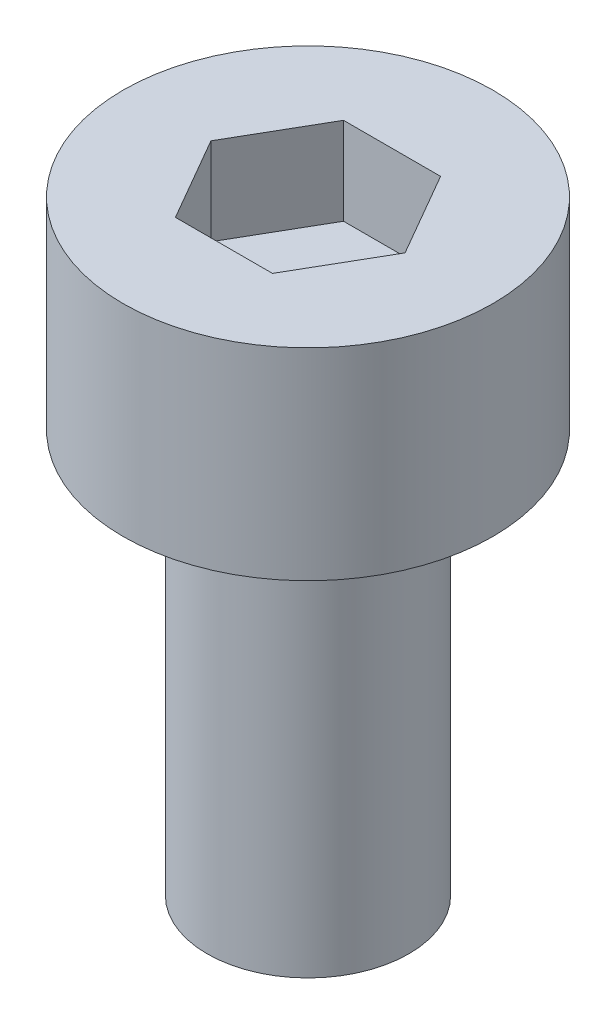
ISO-10303-21;
HEADER;
FILE_DESCRIPTION(('STEP AP214'),'2;1');
FILE_NAME('part.step','',(''),(''),'','','');
FILE_SCHEMA(('AUTOMOTIVE_DESIGN { 1 0 10303 214 1 1 1 1 }'));
ENDSEC;
DATA;
#1=APPLICATION_CONTEXT('core data for automotive mechanical design processes');
#2=APPLICATION_PROTOCOL_DEFINITION('international standard','automotive_design',2000,#1);
#3=PRODUCT_CONTEXT('',#1,'mechanical');
#4=PRODUCT('Part','Part','',(#3));
#5=PRODUCT_RELATED_PRODUCT_CATEGORY('part','',(#4));
#6=PRODUCT_DEFINITION_FORMATION('','',#4);
#7=PRODUCT_DEFINITION_CONTEXT('part definition',#1,'design');
#8=PRODUCT_DEFINITION('design','',#6,#7);
#9=PRODUCT_DEFINITION_SHAPE('','',#8);
#10=(LENGTH_UNIT() NAMED_UNIT(*) SI_UNIT(.MILLI.,.METRE.));
#11=(NAMED_UNIT(*) PLANE_ANGLE_UNIT() SI_UNIT($,.RADIAN.));
#12=(NAMED_UNIT(*) SI_UNIT($,.STERADIAN.) SOLID_ANGLE_UNIT());
#13=UNCERTAINTY_MEASURE_WITH_UNIT(LENGTH_MEASURE(1.E-05),#10,'distance_accuracy_value','');
#14=(GEOMETRIC_REPRESENTATION_CONTEXT(3) GLOBAL_UNCERTAINTY_ASSIGNED_CONTEXT((#13)) GLOBAL_UNIT_ASSIGNED_CONTEXT((#10,
#11,#12)) REPRESENTATION_CONTEXT('',''));
#15=CARTESIAN_POINT('',(0.,0.,0.));
#16=DIRECTION('',(0.,0.,1.));
#17=DIRECTION('',(1.,0.,0.));
#18=AXIS2_PLACEMENT_3D('',#15,#16,#17);
#19=CARTESIAN_POINT('',(0.,3.,0.));
#20=DIRECTION('',(0.,-1.,0.));
#21=DIRECTION('',(0.,0.,-1.));
#22=AXIS2_PLACEMENT_3D('',#19,#20,#21);
#23=CYLINDRICAL_SURFACE('',#22,2.75);
#24=CARTESIAN_POINT('',(0.,3.,0.));
#25=DIRECTION('',(0.,1.,0.));
#26=DIRECTION('',(0.,0.,1.));
#27=AXIS2_PLACEMENT_3D('',#24,#25,#26);
#28=CIRCLE('',#27,2.75);
#29=CARTESIAN_POINT('',(0.,3.,2.75));
#30=VERTEX_POINT('',#29);
#31=EDGE_CURVE('E45',#30,#30,#28,.T.);
#32=ORIENTED_EDGE('',*,*,#31,.F.);
#33=EDGE_LOOP('',(#32));
#34=FACE_BOUND('',#33,.T.);
#35=CARTESIAN_POINT('',(0.,0.,0.));
#36=DIRECTION('',(0.,1.,0.));
#37=DIRECTION('',(0.,0.,1.));
#38=AXIS2_PLACEMENT_3D('',#35,#36,#37);
#39=CIRCLE('',#38,2.75);
#40=CARTESIAN_POINT('',(0.,0.,2.75));
#41=VERTEX_POINT('',#40);
#42=EDGE_CURVE('E40',#41,#41,#39,.T.);
#43=ORIENTED_EDGE('',*,*,#42,.T.);
#44=EDGE_LOOP('',(#43));
#45=FACE_BOUND('',#44,.T.);
#46=ADVANCED_FACE('F37',(#34,#45),#23,.T.);
#47=CARTESIAN_POINT('',(0.,3.,0.));
#48=DIRECTION('',(0.,1.,0.));
#49=DIRECTION('',(0.,0.,1.));
#50=AXIS2_PLACEMENT_3D('',#47,#48,#49);
#51=PLANE('',#50);
#52=DIRECTION('',(0.5,0.,-0.866025403784439));
#53=VECTOR('',#52,1.);
#54=CARTESIAN_POINT('',(0.721687836487032,3.,1.25));
#55=LINE('',#54,#53);
#56=CARTESIAN_POINT('',(0.721687836487032,3.,1.25));
#57=VERTEX_POINT('',#56);
#58=CARTESIAN_POINT('',(1.44337567297406,3.,0.));
#59=VERTEX_POINT('',#58);
#60=EDGE_CURVE('E53',#57,#59,#55,.T.);
#61=ORIENTED_EDGE('',*,*,#60,.F.);
#62=DIRECTION('',(1.,0.,0.));
#63=VECTOR('',#62,1.);
#64=CARTESIAN_POINT('',(-0.721687836487033,3.,1.25));
#65=LINE('',#64,#63);
#66=CARTESIAN_POINT('',(-0.721687836487033,3.,1.25));
#67=VERTEX_POINT('',#66);
#68=EDGE_CURVE('E137',#67,#57,#65,.T.);
#69=ORIENTED_EDGE('',*,*,#68,.F.);
#70=DIRECTION('',(0.5,0.,0.866025403784439));
#71=VECTOR('',#70,1.);
#72=CARTESIAN_POINT('',(-1.44337567297407,3.,0.));
#73=LINE('',#72,#71);
#74=CARTESIAN_POINT('',(-1.44337567297407,3.,0.));
#75=VERTEX_POINT('',#74);
#76=EDGE_CURVE('E135',#75,#67,#73,.T.);
#77=ORIENTED_EDGE('',*,*,#76,.F.);
#78=DIRECTION('',(-0.5,0.,0.866025403784438));
#79=VECTOR('',#78,1.);
#80=CARTESIAN_POINT('',(-0.721687836487033,3.,-1.25));
#81=LINE('',#80,#79);
#82=CARTESIAN_POINT('',(-0.721687836487033,3.,-1.25));
#83=VERTEX_POINT('',#82);
#84=EDGE_CURVE('E101',#83,#75,#81,.T.);
#85=ORIENTED_EDGE('',*,*,#84,.F.);
#86=DIRECTION('',(-1.,0.,0.));
#87=VECTOR('',#86,1.);
#88=CARTESIAN_POINT('',(0.721687836487032,3.,-1.25));
#89=LINE('',#88,#87);
#90=CARTESIAN_POINT('',(0.721687836487032,3.,-1.25));
#91=VERTEX_POINT('',#90);
#92=EDGE_CURVE('E131',#91,#83,#89,.T.);
#93=ORIENTED_EDGE('',*,*,#92,.F.);
#94=DIRECTION('',(-0.5,0.,-0.866025403784439));
#95=VECTOR('',#94,1.);
#96=CARTESIAN_POINT('',(1.44337567297406,3.,0.));
#97=LINE('',#96,#95);
#98=EDGE_CURVE('E127',#59,#91,#97,.T.);
#99=ORIENTED_EDGE('',*,*,#98,.F.);
#100=EDGE_LOOP('',(#61,#69,#77,#85,#93,#99));
#101=FACE_BOUND('',#100,.T.);
#102=ORIENTED_EDGE('',*,*,#31,.T.);
#103=EDGE_LOOP('',(#102));
#104=FACE_BOUND('',#103,.T.);
#105=ADVANCED_FACE('F155',(#101,#104),#51,.T.);
#106=CARTESIAN_POINT('',(0.,0.,0.));
#107=DIRECTION('',(0.,1.,0.));
#108=DIRECTION('',(0.,0.,1.));
#109=AXIS2_PLACEMENT_3D('',#106,#107,#108);
#110=PLANE('',#109);
#111=CARTESIAN_POINT('',(0.,0.,0.));
#112=DIRECTION('',(0.,-1.,0.));
#113=DIRECTION('',(0.,0.,-1.));
#114=AXIS2_PLACEMENT_3D('',#111,#112,#113);
#115=CIRCLE('',#114,1.5);
#116=CARTESIAN_POINT('',(0.,0.,-1.5));
#117=VERTEX_POINT('',#116);
#118=EDGE_CURVE('E11',#117,#117,#115,.T.);
#119=ORIENTED_EDGE('',*,*,#118,.F.);
#120=EDGE_LOOP('',(#119));
#121=FACE_BOUND('',#120,.T.);
#122=ORIENTED_EDGE('',*,*,#42,.F.);
#123=EDGE_LOOP('',(#122));
#124=FACE_BOUND('',#123,.T.);
#125=ADVANCED_FACE('F152',(#121,#124),#110,.F.);
#126=CARTESIAN_POINT('',(0.721687836487032,1.7,1.25));
#127=DIRECTION('',(0.866025403784439,0.,0.5));
#128=DIRECTION('',(0.5,0.,-0.866025403784439));
#129=AXIS2_PLACEMENT_3D('',#126,#127,#128);
#130=PLANE('',#129);
#131=ORIENTED_EDGE('',*,*,#60,.T.);
#132=DIRECTION('',(0.,1.,0.));
#133=VECTOR('',#132,1.);
#134=CARTESIAN_POINT('',(1.44337567297406,1.7,0.));
#135=LINE('',#134,#133);
#136=CARTESIAN_POINT('',(1.44337567297406,1.7,0.));
#137=VERTEX_POINT('',#136);
#138=EDGE_CURVE('E83',#137,#59,#135,.T.);
#139=ORIENTED_EDGE('',*,*,#138,.F.);
#140=DIRECTION('',(0.5,0.,-0.866025403784439));
#141=VECTOR('',#140,1.);
#142=CARTESIAN_POINT('',(0.721687836487032,1.7,1.25));
#143=LINE('',#142,#141);
#144=CARTESIAN_POINT('',(0.721687836487032,1.7,1.25));
#145=VERTEX_POINT('',#144);
#146=EDGE_CURVE('E139',#145,#137,#143,.T.);
#147=ORIENTED_EDGE('',*,*,#146,.F.);
#148=DIRECTION('',(0.,1.,0.));
#149=VECTOR('',#148,1.);
#150=CARTESIAN_POINT('',(0.721687836487032,1.7,1.25));
#151=LINE('',#150,#149);
#152=EDGE_CURVE('E61',#145,#57,#151,.T.);
#153=ORIENTED_EDGE('',*,*,#152,.T.);
#154=EDGE_LOOP('',(#131,#139,#147,#153));
#155=FACE_BOUND('',#154,.T.);
#156=ADVANCED_FACE('F154',(#155),#130,.F.);
#157=CARTESIAN_POINT('',(-0.721687836487033,1.7,1.25));
#158=DIRECTION('',(0.,0.,1.));
#159=DIRECTION('',(1.,0.,0.));
#160=AXIS2_PLACEMENT_3D('',#157,#158,#159);
#161=PLANE('',#160);
#162=ORIENTED_EDGE('',*,*,#68,.T.);
#163=ORIENTED_EDGE('',*,*,#152,.F.);
#164=DIRECTION('',(1.,0.,0.));
#165=VECTOR('',#164,1.);
#166=CARTESIAN_POINT('',(-0.721687836487033,1.7,1.25));
#167=LINE('',#166,#165);
#168=CARTESIAN_POINT('',(-0.721687836487033,1.7,1.25));
#169=VERTEX_POINT('',#168);
#170=EDGE_CURVE('E113',#169,#145,#167,.T.);
#171=ORIENTED_EDGE('',*,*,#170,.F.);
#172=DIRECTION('',(0.,1.,0.));
#173=VECTOR('',#172,1.);
#174=CARTESIAN_POINT('',(-0.721687836487033,1.7,1.25));
#175=LINE('',#174,#173);
#176=EDGE_CURVE('E105',#169,#67,#175,.T.);
#177=ORIENTED_EDGE('',*,*,#176,.T.);
#178=EDGE_LOOP('',(#162,#163,#171,#177));
#179=FACE_BOUND('',#178,.T.);
#180=ADVANCED_FACE('F161',(#179),#161,.F.);
#181=CARTESIAN_POINT('',(-1.44337567297407,1.7,0.));
#182=DIRECTION('',(-0.866025403784439,0.,0.5));
#183=DIRECTION('',(0.5,0.,0.866025403784439));
#184=AXIS2_PLACEMENT_3D('',#181,#182,#183);
#185=PLANE('',#184);
#186=ORIENTED_EDGE('',*,*,#76,.T.);
#187=ORIENTED_EDGE('',*,*,#176,.F.);
#188=DIRECTION('',(0.5,0.,0.866025403784439));
#189=VECTOR('',#188,1.);
#190=CARTESIAN_POINT('',(-1.44337567297407,1.7,0.));
#191=LINE('',#190,#189);
#192=CARTESIAN_POINT('',(-1.44337567297407,1.7,0.));
#193=VERTEX_POINT('',#192);
#194=EDGE_CURVE('E109',#193,#169,#191,.T.);
#195=ORIENTED_EDGE('',*,*,#194,.F.);
#196=DIRECTION('',(0.,1.,0.));
#197=VECTOR('',#196,1.);
#198=CARTESIAN_POINT('',(-1.44337567297407,1.7,0.));
#199=LINE('',#198,#197);
#200=EDGE_CURVE('E94',#193,#75,#199,.T.);
#201=ORIENTED_EDGE('',*,*,#200,.T.);
#202=EDGE_LOOP('',(#186,#187,#195,#201));
#203=FACE_BOUND('',#202,.T.);
#204=ADVANCED_FACE('F110',(#203),#185,.F.);
#205=CARTESIAN_POINT('',(-0.721687836487033,1.7,-1.25));
#206=DIRECTION('',(-0.866025403784439,0.,-0.5));
#207=DIRECTION('',(-0.5,0.,0.866025403784439));
#208=AXIS2_PLACEMENT_3D('',#205,#206,#207);
#209=PLANE('',#208);
#210=ORIENTED_EDGE('',*,*,#84,.T.);
#211=ORIENTED_EDGE('',*,*,#200,.F.);
#212=DIRECTION('',(-0.5,0.,0.866025403784438));
#213=VECTOR('',#212,1.);
#214=CARTESIAN_POINT('',(-0.721687836487033,1.7,-1.25));
#215=LINE('',#214,#213);
#216=CARTESIAN_POINT('',(-0.721687836487033,1.7,-1.25));
#217=VERTEX_POINT('',#216);
#218=EDGE_CURVE('E98',#217,#193,#215,.T.);
#219=ORIENTED_EDGE('',*,*,#218,.F.);
#220=DIRECTION('',(0.,1.,0.));
#221=VECTOR('',#220,1.);
#222=CARTESIAN_POINT('',(-0.721687836487033,1.7,-1.25));
#223=LINE('',#222,#221);
#224=EDGE_CURVE('E106',#217,#83,#223,.T.);
#225=ORIENTED_EDGE('',*,*,#224,.T.);
#226=EDGE_LOOP('',(#210,#211,#219,#225));
#227=FACE_BOUND('',#226,.T.);
#228=ADVANCED_FACE('F96',(#227),#209,.F.);
#229=CARTESIAN_POINT('',(0.721687836487032,1.7,-1.25));
#230=DIRECTION('',(0.,0.,-1.));
#231=DIRECTION('',(-1.,0.,0.));
#232=AXIS2_PLACEMENT_3D('',#229,#230,#231);
#233=PLANE('',#232);
#234=ORIENTED_EDGE('',*,*,#92,.T.);
#235=ORIENTED_EDGE('',*,*,#224,.F.);
#236=DIRECTION('',(-1.,0.,0.));
#237=VECTOR('',#236,1.);
#238=CARTESIAN_POINT('',(0.721687836487032,1.7,-1.25));
#239=LINE('',#238,#237);
#240=CARTESIAN_POINT('',(0.721687836487032,1.7,-1.25));
#241=VERTEX_POINT('',#240);
#242=EDGE_CURVE('E119',#241,#217,#239,.T.);
#243=ORIENTED_EDGE('',*,*,#242,.F.);
#244=DIRECTION('',(0.,1.,0.));
#245=VECTOR('',#244,1.);
#246=CARTESIAN_POINT('',(0.721687836487032,1.7,-1.25));
#247=LINE('',#246,#245);
#248=EDGE_CURVE('E143',#241,#91,#247,.T.);
#249=ORIENTED_EDGE('',*,*,#248,.T.);
#250=EDGE_LOOP('',(#234,#235,#243,#249));
#251=FACE_BOUND('',#250,.T.);
#252=ADVANCED_FACE('F206',(#251),#233,.F.);
#253=CARTESIAN_POINT('',(1.44337567297406,1.7,0.));
#254=DIRECTION('',(0.866025403784439,0.,-0.5));
#255=DIRECTION('',(-0.5,0.,-0.866025403784439));
#256=AXIS2_PLACEMENT_3D('',#253,#254,#255);
#257=PLANE('',#256);
#258=ORIENTED_EDGE('',*,*,#98,.T.);
#259=ORIENTED_EDGE('',*,*,#248,.F.);
#260=DIRECTION('',(-0.5,0.,-0.866025403784439));
#261=VECTOR('',#260,1.);
#262=CARTESIAN_POINT('',(1.44337567297406,1.7,0.));
#263=LINE('',#262,#261);
#264=EDGE_CURVE('E121',#137,#241,#263,.T.);
#265=ORIENTED_EDGE('',*,*,#264,.F.);
#266=ORIENTED_EDGE('',*,*,#138,.T.);
#267=EDGE_LOOP('',(#258,#259,#265,#266));
#268=FACE_BOUND('',#267,.T.);
#269=ADVANCED_FACE('F215',(#268),#257,.F.);
#270=CARTESIAN_POINT('',(0.,1.7,0.));
#271=DIRECTION('',(0.,1.,0.));
#272=DIRECTION('',(0.,0.,1.));
#273=AXIS2_PLACEMENT_3D('',#270,#271,#272);
#274=PLANE('',#273);
#275=ORIENTED_EDGE('',*,*,#146,.T.);
#276=ORIENTED_EDGE('',*,*,#264,.T.);
#277=ORIENTED_EDGE('',*,*,#242,.T.);
#278=ORIENTED_EDGE('',*,*,#218,.T.);
#279=ORIENTED_EDGE('',*,*,#194,.T.);
#280=ORIENTED_EDGE('',*,*,#170,.T.);
#281=EDGE_LOOP('',(#275,#276,#277,#278,#279,#280));
#282=FACE_BOUND('',#281,.T.);
#283=ADVANCED_FACE('F116',(#282),#274,.T.);
#284=CARTESIAN_POINT('',(0.,-6.,0.));
#285=DIRECTION('',(0.,1.,0.));
#286=DIRECTION('',(0.,0.,1.));
#287=AXIS2_PLACEMENT_3D('',#284,#285,#286);
#288=CYLINDRICAL_SURFACE('',#287,1.5);
#289=CARTESIAN_POINT('',(0.,-6.,0.));
#290=DIRECTION('',(0.,-1.,0.));
#291=DIRECTION('',(0.,0.,-1.));
#292=AXIS2_PLACEMENT_3D('',#289,#290,#291);
#293=CIRCLE('',#292,1.5);
#294=CARTESIAN_POINT('',(0.,-6.,-1.5));
#295=VERTEX_POINT('',#294);
#296=EDGE_CURVE('E128',#295,#295,#293,.T.);
#297=ORIENTED_EDGE('',*,*,#296,.F.);
#298=EDGE_LOOP('',(#297));
#299=FACE_BOUND('',#298,.T.);
#300=ORIENTED_EDGE('',*,*,#118,.T.);
#301=EDGE_LOOP('',(#300));
#302=FACE_BOUND('',#301,.T.);
#303=ADVANCED_FACE('F233',(#299,#302),#288,.T.);
#304=CARTESIAN_POINT('',(0.,-6.,0.));
#305=DIRECTION('',(0.,-1.,0.));
#306=DIRECTION('',(0.,0.,-1.));
#307=AXIS2_PLACEMENT_3D('',#304,#305,#306);
#308=PLANE('',#307);
#309=ORIENTED_EDGE('',*,*,#296,.T.);
#310=EDGE_LOOP('',(#309));
#311=FACE_BOUND('',#310,.T.);
#312=ADVANCED_FACE('F247',(#311),#308,.T.);
#313=CLOSED_SHELL('',(#46,#105,#125,#156,#180,#204,#228,#252,#269,#283,#303,#312));
#314=MANIFOLD_SOLID_BREP('B2',#313);
#315=ADVANCED_BREP_SHAPE_REPRESENTATION('',(#18,#314),#14);
#316=SHAPE_DEFINITION_REPRESENTATION(#9,#315);
ENDSEC;
END-ISO-10303-21;
